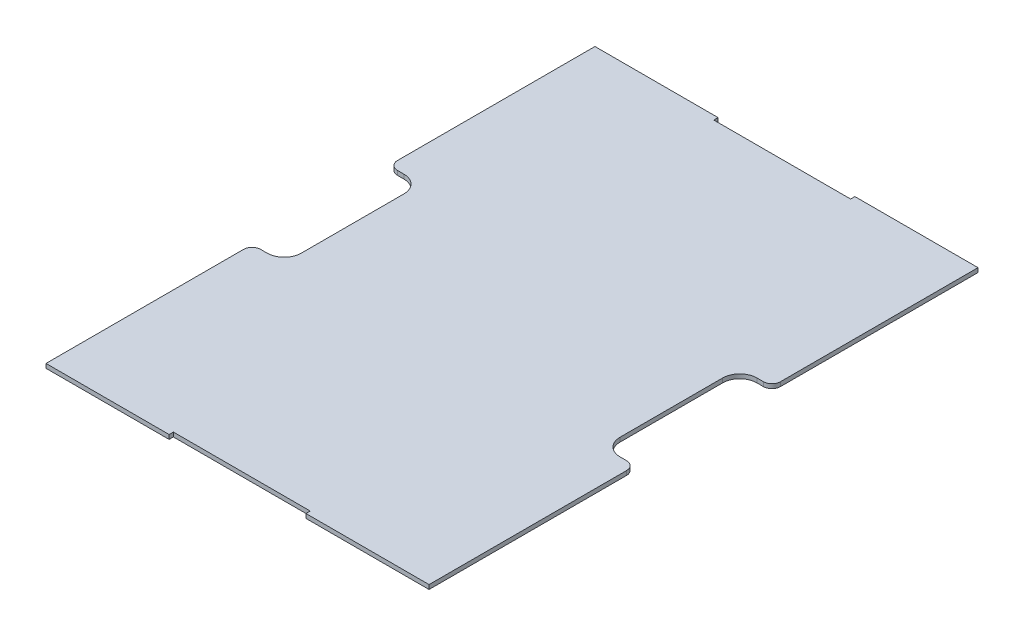
ISO-10303-21;
HEADER;
FILE_DESCRIPTION(('STEP AP214'),'2;1');
FILE_NAME('part.step','',(''),(''),'','','');
FILE_SCHEMA(('AUTOMOTIVE_DESIGN { 1 0 10303 214 1 1 1 1 }'));
ENDSEC;
DATA;
#1=APPLICATION_CONTEXT('core data for automotive mechanical design processes');
#2=APPLICATION_PROTOCOL_DEFINITION('international standard','automotive_design',2000,#1);
#3=PRODUCT_CONTEXT('',#1,'mechanical');
#4=PRODUCT('Part','Part','',(#3));
#5=PRODUCT_RELATED_PRODUCT_CATEGORY('part','',(#4));
#6=PRODUCT_DEFINITION_FORMATION('','',#4);
#7=PRODUCT_DEFINITION_CONTEXT('part definition',#1,'design');
#8=PRODUCT_DEFINITION('design','',#6,#7);
#9=PRODUCT_DEFINITION_SHAPE('','',#8);
#10=(LENGTH_UNIT() NAMED_UNIT(*) SI_UNIT(.MILLI.,.METRE.));
#11=(NAMED_UNIT(*) PLANE_ANGLE_UNIT() SI_UNIT($,.RADIAN.));
#12=(NAMED_UNIT(*) SI_UNIT($,.STERADIAN.) SOLID_ANGLE_UNIT());
#13=UNCERTAINTY_MEASURE_WITH_UNIT(LENGTH_MEASURE(1.E-05),#10,'distance_accuracy_value','');
#14=(GEOMETRIC_REPRESENTATION_CONTEXT(3) GLOBAL_UNCERTAINTY_ASSIGNED_CONTEXT((#13)) GLOBAL_UNIT_ASSIGNED_CONTEXT((#10,
#11,#12)) REPRESENTATION_CONTEXT('',''));
#15=CARTESIAN_POINT('',(0.,0.,0.));
#16=DIRECTION('',(0.,0.,1.));
#17=DIRECTION('',(1.,0.,0.));
#18=AXIS2_PLACEMENT_3D('',#15,#16,#17);
#19=CARTESIAN_POINT('',(-71.12,0.79375,-101.9175));
#20=DIRECTION('',(1.,0.,0.));
#21=DIRECTION('',(0.,0.,-1.));
#22=AXIS2_PLACEMENT_3D('',#19,#20,#21);
#23=PLANE('',#22);
#24=DIRECTION('',(0.,0.,1.));
#25=VECTOR('',#24,1.);
#26=CARTESIAN_POINT('',(-71.12,-0.79375,-101.9175));
#27=LINE('',#26,#25);
#28=CARTESIAN_POINT('',(-71.12,-0.79375,-101.9175));
#29=VERTEX_POINT('',#28);
#30=CARTESIAN_POINT('',(-71.12,-0.79375,-28.575));
#31=VERTEX_POINT('',#30);
#32=EDGE_CURVE('E279',#29,#31,#27,.T.);
#33=ORIENTED_EDGE('',*,*,#32,.T.);
#34=DIRECTION('',(0.,-1.,0.));
#35=VECTOR('',#34,1.);
#36=CARTESIAN_POINT('',(-71.12,0.79375,-28.575));
#37=LINE('',#36,#35);
#38=CARTESIAN_POINT('',(-71.12,0.79375,-28.575));
#39=VERTEX_POINT('',#38);
#40=EDGE_CURVE('E11',#31,#39,#37,.F.);
#41=ORIENTED_EDGE('',*,*,#40,.T.);
#42=DIRECTION('',(0.,0.,1.));
#43=VECTOR('',#42,1.);
#44=CARTESIAN_POINT('',(-71.12,0.79375,-101.9175));
#45=LINE('',#44,#43);
#46=CARTESIAN_POINT('',(-71.12,0.79375,-101.9175));
#47=VERTEX_POINT('',#46);
#48=EDGE_CURVE('E323',#47,#39,#45,.T.);
#49=ORIENTED_EDGE('',*,*,#48,.F.);
#50=DIRECTION('',(0.,-1.,0.));
#51=VECTOR('',#50,1.);
#52=CARTESIAN_POINT('',(-71.12,0.79375,-101.9175));
#53=LINE('',#52,#51);
#54=EDGE_CURVE('E278',#47,#29,#53,.T.);
#55=ORIENTED_EDGE('',*,*,#54,.T.);
#56=EDGE_LOOP('',(#33,#41,#49,#55));
#57=FACE_BOUND('',#56,.T.);
#58=ADVANCED_FACE('F34',(#57),#23,.F.);
#59=CARTESIAN_POINT('',(-71.12,0.79375,-25.4));
#60=DIRECTION('',(0.,0.,-1.));
#61=DIRECTION('',(-1.,0.,0.));
#62=AXIS2_PLACEMENT_3D('',#59,#60,#61);
#63=PLANE('',#62);
#64=DIRECTION('',(1.,0.,0.));
#65=VECTOR('',#64,1.);
#66=CARTESIAN_POINT('',(-71.12,0.79375,-25.4));
#67=LINE('',#66,#65);
#68=CARTESIAN_POINT('',(-67.945,0.79375,-25.4));
#69=VERTEX_POINT('',#68);
#70=CARTESIAN_POINT('',(-65.5320000000001,0.79375,-25.4));
#71=VERTEX_POINT('',#70);
#72=EDGE_CURVE('E425',#69,#71,#67,.T.);
#73=ORIENTED_EDGE('',*,*,#72,.F.);
#74=DIRECTION('',(0.,-1.,0.));
#75=VECTOR('',#74,1.);
#76=CARTESIAN_POINT('',(-67.945,0.79375,-25.4));
#77=LINE('',#76,#75);
#78=CARTESIAN_POINT('',(-67.945,-0.79375,-25.4));
#79=VERTEX_POINT('',#78);
#80=EDGE_CURVE('E42',#69,#79,#77,.T.);
#81=ORIENTED_EDGE('',*,*,#80,.T.);
#82=DIRECTION('',(1.,0.,0.));
#83=VECTOR('',#82,1.);
#84=CARTESIAN_POINT('',(-71.12,-0.79375,-25.4));
#85=LINE('',#84,#83);
#86=CARTESIAN_POINT('',(-65.5320000000001,-0.79375,-25.4));
#87=VERTEX_POINT('',#86);
#88=EDGE_CURVE('E282',#79,#87,#85,.T.);
#89=ORIENTED_EDGE('',*,*,#88,.T.);
#90=DIRECTION('',(0.,-1.,0.));
#91=VECTOR('',#90,1.);
#92=CARTESIAN_POINT('',(-65.5320000000001,0.79375,-25.4));
#93=LINE('',#92,#91);
#94=EDGE_CURVE('E372',#87,#71,#93,.F.);
#95=ORIENTED_EDGE('',*,*,#94,.T.);
#96=EDGE_LOOP('',(#73,#81,#89,#95));
#97=FACE_BOUND('',#96,.T.);
#98=ADVANCED_FACE('F424',(#97),#63,.F.);
#99=CARTESIAN_POINT('',(-59.182,0.79375,25.4));
#100=DIRECTION('',(1.,0.,0.));
#101=DIRECTION('',(0.,0.,-1.));
#102=AXIS2_PLACEMENT_3D('',#99,#100,#101);
#103=PLANE('',#102);
#104=DIRECTION('',(0.,0.,1.));
#105=VECTOR('',#104,1.);
#106=CARTESIAN_POINT('',(-59.182,-0.79375,25.4));
#107=LINE('',#106,#105);
#108=CARTESIAN_POINT('',(-59.182,-0.79375,-19.05));
#109=VERTEX_POINT('',#108);
#110=CARTESIAN_POINT('',(-59.182,-0.79375,19.05));
#111=VERTEX_POINT('',#110);
#112=EDGE_CURVE('E284',#109,#111,#107,.T.);
#113=ORIENTED_EDGE('',*,*,#112,.T.);
#114=DIRECTION('',(0.,-1.,0.));
#115=VECTOR('',#114,1.);
#116=CARTESIAN_POINT('',(-59.182,0.79375,19.05));
#117=LINE('',#116,#115);
#118=CARTESIAN_POINT('',(-59.182,0.79375,19.05));
#119=VERTEX_POINT('',#118);
#120=EDGE_CURVE('E370',#111,#119,#117,.F.);
#121=ORIENTED_EDGE('',*,*,#120,.T.);
#122=DIRECTION('',(0.,0.,1.));
#123=VECTOR('',#122,1.);
#124=CARTESIAN_POINT('',(-59.182,0.79375,25.4));
#125=LINE('',#124,#123);
#126=CARTESIAN_POINT('',(-59.182,0.79375,-19.05));
#127=VERTEX_POINT('',#126);
#128=EDGE_CURVE('E440',#127,#119,#125,.T.);
#129=ORIENTED_EDGE('',*,*,#128,.F.);
#130=DIRECTION('',(0.,-1.,0.));
#131=VECTOR('',#130,1.);
#132=CARTESIAN_POINT('',(-59.182,-0.79375,-19.05));
#133=LINE('',#132,#131);
#134=EDGE_CURVE('E367',#127,#109,#133,.T.);
#135=ORIENTED_EDGE('',*,*,#134,.T.);
#136=EDGE_LOOP('',(#113,#121,#129,#135));
#137=FACE_BOUND('',#136,.T.);
#138=ADVANCED_FACE('F443',(#137),#103,.F.);
#139=CARTESIAN_POINT('',(-71.12,0.79375,25.4));
#140=DIRECTION('',(0.,0.,1.));
#141=DIRECTION('',(1.,0.,0.));
#142=AXIS2_PLACEMENT_3D('',#139,#140,#141);
#143=PLANE('',#142);
#144=DIRECTION('',(-1.,0.,0.));
#145=VECTOR('',#144,1.);
#146=CARTESIAN_POINT('',(-71.12,-0.79375,25.4));
#147=LINE('',#146,#145);
#148=CARTESIAN_POINT('',(-65.532,-0.79375,25.4));
#149=VERTEX_POINT('',#148);
#150=CARTESIAN_POINT('',(-67.945,-0.79375,25.4));
#151=VERTEX_POINT('',#150);
#152=EDGE_CURVE('E287',#149,#151,#147,.T.);
#153=ORIENTED_EDGE('',*,*,#152,.T.);
#154=DIRECTION('',(0.,-1.,0.));
#155=VECTOR('',#154,1.);
#156=CARTESIAN_POINT('',(-67.945,0.79375,25.4));
#157=LINE('',#156,#155);
#158=CARTESIAN_POINT('',(-67.945,0.79375,25.4));
#159=VERTEX_POINT('',#158);
#160=EDGE_CURVE('E418',#151,#159,#157,.F.);
#161=ORIENTED_EDGE('',*,*,#160,.T.);
#162=DIRECTION('',(-1.,0.,0.));
#163=VECTOR('',#162,1.);
#164=CARTESIAN_POINT('',(-71.12,0.79375,25.4));
#165=LINE('',#164,#163);
#166=CARTESIAN_POINT('',(-65.532,0.79375,25.4));
#167=VERTEX_POINT('',#166);
#168=EDGE_CURVE('E231',#167,#159,#165,.T.);
#169=ORIENTED_EDGE('',*,*,#168,.F.);
#170=DIRECTION('',(0.,-1.,0.));
#171=VECTOR('',#170,1.);
#172=CARTESIAN_POINT('',(-65.532,-0.79375,25.4));
#173=LINE('',#172,#171);
#174=EDGE_CURVE('E364',#167,#149,#173,.T.);
#175=ORIENTED_EDGE('',*,*,#174,.T.);
#176=EDGE_LOOP('',(#153,#161,#169,#175));
#177=FACE_BOUND('',#176,.T.);
#178=ADVANCED_FACE('F616',(#177),#143,.F.);
#179=CARTESIAN_POINT('',(-71.12,0.79375,25.4));
#180=DIRECTION('',(1.,0.,0.));
#181=DIRECTION('',(0.,0.,-1.));
#182=AXIS2_PLACEMENT_3D('',#179,#180,#181);
#183=PLANE('',#182);
#184=DIRECTION('',(0.,0.,1.));
#185=VECTOR('',#184,1.);
#186=CARTESIAN_POINT('',(-71.12,0.79375,25.4));
#187=LINE('',#186,#185);
#188=CARTESIAN_POINT('',(-71.12,0.79375,28.575));
#189=VERTEX_POINT('',#188);
#190=CARTESIAN_POINT('',(-71.12,0.79375,101.9175));
#191=VERTEX_POINT('',#190);
#192=EDGE_CURVE('E218',#189,#191,#187,.T.);
#193=ORIENTED_EDGE('',*,*,#192,.F.);
#194=DIRECTION('',(0.,-1.,0.));
#195=VECTOR('',#194,1.);
#196=CARTESIAN_POINT('',(-71.12,0.79375,28.575));
#197=LINE('',#196,#195);
#198=CARTESIAN_POINT('',(-71.12,-0.79375,28.575));
#199=VERTEX_POINT('',#198);
#200=EDGE_CURVE('E416',#189,#199,#197,.T.);
#201=ORIENTED_EDGE('',*,*,#200,.T.);
#202=DIRECTION('',(0.,0.,1.));
#203=VECTOR('',#202,1.);
#204=CARTESIAN_POINT('',(-71.12,-0.79375,25.4));
#205=LINE('',#204,#203);
#206=CARTESIAN_POINT('',(-71.12,-0.79375,101.9175));
#207=VERTEX_POINT('',#206);
#208=EDGE_CURVE('E237',#199,#207,#205,.T.);
#209=ORIENTED_EDGE('',*,*,#208,.T.);
#210=DIRECTION('',(0.,-1.,0.));
#211=VECTOR('',#210,1.);
#212=CARTESIAN_POINT('',(-71.12,0.79375,101.9175));
#213=LINE('',#212,#211);
#214=EDGE_CURVE('E234',#191,#207,#213,.T.);
#215=ORIENTED_EDGE('',*,*,#214,.F.);
#216=EDGE_LOOP('',(#193,#201,#209,#215));
#217=FACE_BOUND('',#216,.T.);
#218=ADVANCED_FACE('F235',(#217),#183,.F.);
#219=CARTESIAN_POINT('',(-71.12,0.79375,101.9175));
#220=DIRECTION('',(0.,0.,-1.));
#221=DIRECTION('',(-1.,0.,0.));
#222=AXIS2_PLACEMENT_3D('',#219,#220,#221);
#223=PLANE('',#222);
#224=DIRECTION('',(1.,0.,0.));
#225=VECTOR('',#224,1.);
#226=CARTESIAN_POINT('',(-71.12,-0.79375,101.9175));
#227=LINE('',#226,#225);
#228=CARTESIAN_POINT('',(-25.4,-0.79375,101.9175));
#229=VERTEX_POINT('',#228);
#230=EDGE_CURVE('E291',#207,#229,#227,.T.);
#231=ORIENTED_EDGE('',*,*,#230,.T.);
#232=DIRECTION('',(0.,-1.,0.));
#233=VECTOR('',#232,1.);
#234=CARTESIAN_POINT('',(-25.4,0.79375,101.9175));
#235=LINE('',#234,#233);
#236=CARTESIAN_POINT('',(-25.4,0.79375,101.9175));
#237=VERTEX_POINT('',#236);
#238=EDGE_CURVE('E241',#237,#229,#235,.T.);
#239=ORIENTED_EDGE('',*,*,#238,.F.);
#240=DIRECTION('',(1.,0.,0.));
#241=VECTOR('',#240,1.);
#242=CARTESIAN_POINT('',(-71.12,0.79375,101.9175));
#243=LINE('',#242,#241);
#244=EDGE_CURVE('E223',#191,#237,#243,.T.);
#245=ORIENTED_EDGE('',*,*,#244,.F.);
#246=ORIENTED_EDGE('',*,*,#214,.T.);
#247=EDGE_LOOP('',(#231,#239,#245,#246));
#248=FACE_BOUND('',#247,.T.);
#249=ADVANCED_FACE('F243',(#248),#223,.F.);
#250=CARTESIAN_POINT('',(-25.4,0.79375,101.9175));
#251=DIRECTION('',(-1.,0.,0.));
#252=DIRECTION('',(0.,0.,1.));
#253=AXIS2_PLACEMENT_3D('',#250,#251,#252);
#254=PLANE('',#253);
#255=DIRECTION('',(0.,0.,-1.));
#256=VECTOR('',#255,1.);
#257=CARTESIAN_POINT('',(-25.4,-0.79375,101.9175));
#258=LINE('',#257,#256);
#259=CARTESIAN_POINT('',(-25.4,-0.79375,100.33));
#260=VERTEX_POINT('',#259);
#261=EDGE_CURVE('E293',#229,#260,#258,.T.);
#262=ORIENTED_EDGE('',*,*,#261,.T.);
#263=DIRECTION('',(0.,-1.,0.));
#264=VECTOR('',#263,1.);
#265=CARTESIAN_POINT('',(-25.4,0.79375,100.33));
#266=LINE('',#265,#264);
#267=CARTESIAN_POINT('',(-25.4,0.79375,100.33));
#268=VERTEX_POINT('',#267);
#269=EDGE_CURVE('E350',#268,#260,#266,.T.);
#270=ORIENTED_EDGE('',*,*,#269,.F.);
#271=DIRECTION('',(0.,0.,-1.));
#272=VECTOR('',#271,1.);
#273=CARTESIAN_POINT('',(-25.4,0.79375,101.9175));
#274=LINE('',#273,#272);
#275=EDGE_CURVE('E246',#237,#268,#274,.T.);
#276=ORIENTED_EDGE('',*,*,#275,.F.);
#277=ORIENTED_EDGE('',*,*,#238,.T.);
#278=EDGE_LOOP('',(#262,#270,#276,#277));
#279=FACE_BOUND('',#278,.T.);
#280=ADVANCED_FACE('F686',(#279),#254,.F.);
#281=CARTESIAN_POINT('',(-25.4,0.79375,100.33));
#282=DIRECTION('',(0.,0.,-1.));
#283=DIRECTION('',(-1.,0.,0.));
#284=AXIS2_PLACEMENT_3D('',#281,#282,#283);
#285=PLANE('',#284);
#286=DIRECTION('',(1.,0.,0.));
#287=VECTOR('',#286,1.);
#288=CARTESIAN_POINT('',(-25.4,-0.79375,100.33));
#289=LINE('',#288,#287);
#290=CARTESIAN_POINT('',(25.4,-0.79375,100.33));
#291=VERTEX_POINT('',#290);
#292=EDGE_CURVE('E295',#260,#291,#289,.T.);
#293=ORIENTED_EDGE('',*,*,#292,.T.);
#294=DIRECTION('',(0.,-1.,0.));
#295=VECTOR('',#294,1.);
#296=CARTESIAN_POINT('',(25.4,0.79375,100.33));
#297=LINE('',#296,#295);
#298=CARTESIAN_POINT('',(25.4,0.79375,100.33));
#299=VERTEX_POINT('',#298);
#300=EDGE_CURVE('E347',#299,#291,#297,.T.);
#301=ORIENTED_EDGE('',*,*,#300,.F.);
#302=DIRECTION('',(1.,0.,0.));
#303=VECTOR('',#302,1.);
#304=CARTESIAN_POINT('',(-25.4,0.79375,100.33));
#305=LINE('',#304,#303);
#306=EDGE_CURVE('E248',#268,#299,#305,.T.);
#307=ORIENTED_EDGE('',*,*,#306,.F.);
#308=ORIENTED_EDGE('',*,*,#269,.T.);
#309=EDGE_LOOP('',(#293,#301,#307,#308));
#310=FACE_BOUND('',#309,.T.);
#311=ADVANCED_FACE('F682',(#310),#285,.F.);
#312=CARTESIAN_POINT('',(25.4,0.79375,101.9175));
#313=DIRECTION('',(1.,0.,0.));
#314=DIRECTION('',(0.,0.,-1.));
#315=AXIS2_PLACEMENT_3D('',#312,#313,#314);
#316=PLANE('',#315);
#317=DIRECTION('',(0.,0.,1.));
#318=VECTOR('',#317,1.);
#319=CARTESIAN_POINT('',(25.4,-0.79375,101.9175));
#320=LINE('',#319,#318);
#321=CARTESIAN_POINT('',(25.4,-0.79375,101.9175));
#322=VERTEX_POINT('',#321);
#323=EDGE_CURVE('E297',#291,#322,#320,.T.);
#324=ORIENTED_EDGE('',*,*,#323,.T.);
#325=DIRECTION('',(0.,-1.,0.));
#326=VECTOR('',#325,1.);
#327=CARTESIAN_POINT('',(25.4,0.79375,101.9175));
#328=LINE('',#327,#326);
#329=CARTESIAN_POINT('',(25.4,0.79375,101.9175));
#330=VERTEX_POINT('',#329);
#331=EDGE_CURVE('E344',#330,#322,#328,.T.);
#332=ORIENTED_EDGE('',*,*,#331,.F.);
#333=DIRECTION('',(0.,0.,1.));
#334=VECTOR('',#333,1.);
#335=CARTESIAN_POINT('',(25.4,0.79375,101.9175));
#336=LINE('',#335,#334);
#337=EDGE_CURVE('E253',#299,#330,#336,.T.);
#338=ORIENTED_EDGE('',*,*,#337,.F.);
#339=ORIENTED_EDGE('',*,*,#300,.T.);
#340=EDGE_LOOP('',(#324,#332,#338,#339));
#341=FACE_BOUND('',#340,.T.);
#342=ADVANCED_FACE('F678',(#341),#316,.F.);
#343=CARTESIAN_POINT('',(25.4,0.79375,101.9175));
#344=DIRECTION('',(0.,0.,-1.));
#345=DIRECTION('',(-1.,0.,0.));
#346=AXIS2_PLACEMENT_3D('',#343,#344,#345);
#347=PLANE('',#346);
#348=DIRECTION('',(1.,0.,0.));
#349=VECTOR('',#348,1.);
#350=CARTESIAN_POINT('',(25.4,-0.79375,101.9175));
#351=LINE('',#350,#349);
#352=CARTESIAN_POINT('',(71.12,-0.79375,101.9175));
#353=VERTEX_POINT('',#352);
#354=EDGE_CURVE('E299',#322,#353,#351,.T.);
#355=ORIENTED_EDGE('',*,*,#354,.T.);
#356=DIRECTION('',(0.,-1.,0.));
#357=VECTOR('',#356,1.);
#358=CARTESIAN_POINT('',(71.12,0.79375,101.9175));
#359=LINE('',#358,#357);
#360=CARTESIAN_POINT('',(71.12,0.79375,101.9175));
#361=VERTEX_POINT('',#360);
#362=EDGE_CURVE('E341',#361,#353,#359,.T.);
#363=ORIENTED_EDGE('',*,*,#362,.F.);
#364=DIRECTION('',(1.,0.,0.));
#365=VECTOR('',#364,1.);
#366=CARTESIAN_POINT('',(25.4,0.79375,101.9175));
#367=LINE('',#366,#365);
#368=EDGE_CURVE('E255',#330,#361,#367,.T.);
#369=ORIENTED_EDGE('',*,*,#368,.F.);
#370=ORIENTED_EDGE('',*,*,#331,.T.);
#371=EDGE_LOOP('',(#355,#363,#369,#370));
#372=FACE_BOUND('',#371,.T.);
#373=ADVANCED_FACE('F604',(#372),#347,.F.);
#374=CARTESIAN_POINT('',(71.12,0.79375,25.4));
#375=DIRECTION('',(-1.,0.,0.));
#376=DIRECTION('',(0.,0.,1.));
#377=AXIS2_PLACEMENT_3D('',#374,#375,#376);
#378=PLANE('',#377);
#379=DIRECTION('',(0.,0.,-1.));
#380=VECTOR('',#379,1.);
#381=CARTESIAN_POINT('',(71.12,-0.79375,25.4));
#382=LINE('',#381,#380);
#383=CARTESIAN_POINT('',(71.12,-0.79375,28.575));
#384=VERTEX_POINT('',#383);
#385=EDGE_CURVE('E301',#353,#384,#382,.T.);
#386=ORIENTED_EDGE('',*,*,#385,.T.);
#387=DIRECTION('',(0.,-1.,0.));
#388=VECTOR('',#387,1.);
#389=CARTESIAN_POINT('',(71.12,0.79375,28.575));
#390=LINE('',#389,#388);
#391=CARTESIAN_POINT('',(71.12,0.79375,28.575));
#392=VERTEX_POINT('',#391);
#393=EDGE_CURVE('E404',#384,#392,#390,.F.);
#394=ORIENTED_EDGE('',*,*,#393,.T.);
#395=DIRECTION('',(0.,0.,-1.));
#396=VECTOR('',#395,1.);
#397=CARTESIAN_POINT('',(71.12,0.79375,25.4));
#398=LINE('',#397,#396);
#399=EDGE_CURVE('E257',#361,#392,#398,.T.);
#400=ORIENTED_EDGE('',*,*,#399,.F.);
#401=ORIENTED_EDGE('',*,*,#362,.T.);
#402=EDGE_LOOP('',(#386,#394,#400,#401));
#403=FACE_BOUND('',#402,.T.);
#404=ADVANCED_FACE('F594',(#403),#378,.F.);
#405=CARTESIAN_POINT('',(71.12,0.79375,25.4));
#406=DIRECTION('',(0.,0.,1.));
#407=DIRECTION('',(1.,0.,0.));
#408=AXIS2_PLACEMENT_3D('',#405,#406,#407);
#409=PLANE('',#408);
#410=DIRECTION('',(-1.,0.,0.));
#411=VECTOR('',#410,1.);
#412=CARTESIAN_POINT('',(71.12,0.79375,25.4));
#413=LINE('',#412,#411);
#414=CARTESIAN_POINT('',(67.945,0.79375,25.4));
#415=VERTEX_POINT('',#414);
#416=CARTESIAN_POINT('',(65.532,0.79375,25.4));
#417=VERTEX_POINT('',#416);
#418=EDGE_CURVE('E259',#415,#417,#413,.T.);
#419=ORIENTED_EDGE('',*,*,#418,.F.);
#420=DIRECTION('',(0.,-1.,0.));
#421=VECTOR('',#420,1.);
#422=CARTESIAN_POINT('',(67.945,0.79375,25.4));
#423=LINE('',#422,#421);
#424=CARTESIAN_POINT('',(67.945,-0.79375,25.4));
#425=VERTEX_POINT('',#424);
#426=EDGE_CURVE('E393',#415,#425,#423,.T.);
#427=ORIENTED_EDGE('',*,*,#426,.T.);
#428=DIRECTION('',(-1.,0.,0.));
#429=VECTOR('',#428,1.);
#430=CARTESIAN_POINT('',(71.12,-0.79375,25.4));
#431=LINE('',#430,#429);
#432=CARTESIAN_POINT('',(65.532,-0.79375,25.4));
#433=VERTEX_POINT('',#432);
#434=EDGE_CURVE('E304',#425,#433,#431,.T.);
#435=ORIENTED_EDGE('',*,*,#434,.T.);
#436=DIRECTION('',(0.,-1.,0.));
#437=VECTOR('',#436,1.);
#438=CARTESIAN_POINT('',(65.532,0.79375,25.4));
#439=LINE('',#438,#437);
#440=EDGE_CURVE('E358',#433,#417,#439,.F.);
#441=ORIENTED_EDGE('',*,*,#440,.T.);
#442=EDGE_LOOP('',(#419,#427,#435,#441));
#443=FACE_BOUND('',#442,.T.);
#444=ADVANCED_FACE('F589',(#443),#409,.F.);
#445=CARTESIAN_POINT('',(59.182,0.79375,25.4));
#446=DIRECTION('',(-1.,0.,0.));
#447=DIRECTION('',(0.,0.,1.));
#448=AXIS2_PLACEMENT_3D('',#445,#446,#447);
#449=PLANE('',#448);
#450=DIRECTION('',(0.,0.,-1.));
#451=VECTOR('',#450,1.);
#452=CARTESIAN_POINT('',(59.182,0.79375,25.4));
#453=LINE('',#452,#451);
#454=CARTESIAN_POINT('',(59.182,0.79375,19.05));
#455=VERTEX_POINT('',#454);
#456=CARTESIAN_POINT('',(59.182,0.79375,-19.05));
#457=VERTEX_POINT('',#456);
#458=EDGE_CURVE('E261',#455,#457,#453,.T.);
#459=ORIENTED_EDGE('',*,*,#458,.F.);
#460=DIRECTION('',(0.,-1.,0.));
#461=VECTOR('',#460,1.);
#462=CARTESIAN_POINT('',(59.182,-0.79375,19.05));
#463=LINE('',#462,#461);
#464=CARTESIAN_POINT('',(59.182,-0.79375,19.05));
#465=VERTEX_POINT('',#464);
#466=EDGE_CURVE('E355',#455,#465,#463,.T.);
#467=ORIENTED_EDGE('',*,*,#466,.T.);
#468=DIRECTION('',(0.,0.,-1.));
#469=VECTOR('',#468,1.);
#470=CARTESIAN_POINT('',(59.182,-0.79375,25.4));
#471=LINE('',#470,#469);
#472=CARTESIAN_POINT('',(59.182,-0.79375,-19.05));
#473=VERTEX_POINT('',#472);
#474=EDGE_CURVE('E306',#465,#473,#471,.T.);
#475=ORIENTED_EDGE('',*,*,#474,.T.);
#476=DIRECTION('',(0.,-1.,0.));
#477=VECTOR('',#476,1.);
#478=CARTESIAN_POINT('',(59.182,0.79375,-19.05));
#479=LINE('',#478,#477);
#480=EDGE_CURVE('E240',#473,#457,#479,.F.);
#481=ORIENTED_EDGE('',*,*,#480,.T.);
#482=EDGE_LOOP('',(#459,#467,#475,#481));
#483=FACE_BOUND('',#482,.T.);
#484=ADVANCED_FACE('F582',(#483),#449,.F.);
#485=CARTESIAN_POINT('',(71.12,0.79375,-25.4));
#486=DIRECTION('',(0.,0.,-1.));
#487=DIRECTION('',(-1.,0.,0.));
#488=AXIS2_PLACEMENT_3D('',#485,#486,#487);
#489=PLANE('',#488);
#490=DIRECTION('',(1.,0.,0.));
#491=VECTOR('',#490,1.);
#492=CARTESIAN_POINT('',(71.12,-0.79375,-25.4));
#493=LINE('',#492,#491);
#494=CARTESIAN_POINT('',(65.532,-0.79375,-25.4));
#495=VERTEX_POINT('',#494);
#496=CARTESIAN_POINT('',(67.945,-0.79375,-25.4));
#497=VERTEX_POINT('',#496);
#498=EDGE_CURVE('E309',#495,#497,#493,.T.);
#499=ORIENTED_EDGE('',*,*,#498,.T.);
#500=DIRECTION('',(0.,-1.,0.));
#501=VECTOR('',#500,1.);
#502=CARTESIAN_POINT('',(67.945,0.79375,-25.4));
#503=LINE('',#502,#501);
#504=CARTESIAN_POINT('',(67.945,0.79375,-25.4));
#505=VERTEX_POINT('',#504);
#506=EDGE_CURVE('E57',#497,#505,#503,.F.);
#507=ORIENTED_EDGE('',*,*,#506,.T.);
#508=DIRECTION('',(1.,0.,0.));
#509=VECTOR('',#508,1.);
#510=CARTESIAN_POINT('',(71.12,0.79375,-25.4));
#511=LINE('',#510,#509);
#512=CARTESIAN_POINT('',(65.532,0.79375,-25.4));
#513=VERTEX_POINT('',#512);
#514=EDGE_CURVE('E264',#513,#505,#511,.T.);
#515=ORIENTED_EDGE('',*,*,#514,.F.);
#516=DIRECTION('',(0.,-1.,0.));
#517=VECTOR('',#516,1.);
#518=CARTESIAN_POINT('',(65.532,-0.79375,-25.4));
#519=LINE('',#518,#517);
#520=EDGE_CURVE('E361',#513,#495,#519,.T.);
#521=ORIENTED_EDGE('',*,*,#520,.T.);
#522=EDGE_LOOP('',(#499,#507,#515,#521));
#523=FACE_BOUND('',#522,.T.);
#524=ADVANCED_FACE('F484',(#523),#489,.F.);
#525=CARTESIAN_POINT('',(71.12,0.79375,-101.9175));
#526=DIRECTION('',(-1.,0.,0.));
#527=DIRECTION('',(0.,0.,1.));
#528=AXIS2_PLACEMENT_3D('',#525,#526,#527);
#529=PLANE('',#528);
#530=DIRECTION('',(0.,0.,-1.));
#531=VECTOR('',#530,1.);
#532=CARTESIAN_POINT('',(71.12,0.79375,-101.9175));
#533=LINE('',#532,#531);
#534=CARTESIAN_POINT('',(71.12,0.79375,-28.575));
#535=VERTEX_POINT('',#534);
#536=CARTESIAN_POINT('',(71.12,0.79375,-101.9175));
#537=VERTEX_POINT('',#536);
#538=EDGE_CURVE('E266',#535,#537,#533,.T.);
#539=ORIENTED_EDGE('',*,*,#538,.F.);
#540=DIRECTION('',(0.,-1.,0.));
#541=VECTOR('',#540,1.);
#542=CARTESIAN_POINT('',(71.12,0.79375,-28.575));
#543=LINE('',#542,#541);
#544=CARTESIAN_POINT('',(71.12,-0.79375,-28.575));
#545=VERTEX_POINT('',#544);
#546=EDGE_CURVE('E412',#535,#545,#543,.T.);
#547=ORIENTED_EDGE('',*,*,#546,.T.);
#548=DIRECTION('',(0.,0.,-1.));
#549=VECTOR('',#548,1.);
#550=CARTESIAN_POINT('',(71.12,-0.79375,-101.9175));
#551=LINE('',#550,#549);
#552=CARTESIAN_POINT('',(71.12,-0.79375,-101.9175));
#553=VERTEX_POINT('',#552);
#554=EDGE_CURVE('E311',#545,#553,#551,.T.);
#555=ORIENTED_EDGE('',*,*,#554,.T.);
#556=DIRECTION('',(0.,-1.,0.));
#557=VECTOR('',#556,1.);
#558=CARTESIAN_POINT('',(71.12,0.79375,-101.9175));
#559=LINE('',#558,#557);
#560=EDGE_CURVE('E338',#537,#553,#559,.T.);
#561=ORIENTED_EDGE('',*,*,#560,.F.);
#562=EDGE_LOOP('',(#539,#547,#555,#561));
#563=FACE_BOUND('',#562,.T.);
#564=ADVANCED_FACE('F480',(#563),#529,.F.);
#565=CARTESIAN_POINT('',(25.4,0.79375,-101.9175));
#566=DIRECTION('',(0.,0.,1.));
#567=DIRECTION('',(1.,0.,0.));
#568=AXIS2_PLACEMENT_3D('',#565,#566,#567);
#569=PLANE('',#568);
#570=DIRECTION('',(-1.,0.,0.));
#571=VECTOR('',#570,1.);
#572=CARTESIAN_POINT('',(25.4,-0.79375,-101.9175));
#573=LINE('',#572,#571);
#574=CARTESIAN_POINT('',(25.4,-0.79375,-101.9175));
#575=VERTEX_POINT('',#574);
#576=EDGE_CURVE('E313',#553,#575,#573,.T.);
#577=ORIENTED_EDGE('',*,*,#576,.T.);
#578=DIRECTION('',(0.,-1.,0.));
#579=VECTOR('',#578,1.);
#580=CARTESIAN_POINT('',(25.4,0.79375,-101.9175));
#581=LINE('',#580,#579);
#582=CARTESIAN_POINT('',(25.4,0.79375,-101.9175));
#583=VERTEX_POINT('',#582);
#584=EDGE_CURVE('E335',#583,#575,#581,.T.);
#585=ORIENTED_EDGE('',*,*,#584,.F.);
#586=DIRECTION('',(-1.,0.,0.));
#587=VECTOR('',#586,1.);
#588=CARTESIAN_POINT('',(25.4,0.79375,-101.9175));
#589=LINE('',#588,#587);
#590=EDGE_CURVE('E268',#537,#583,#589,.T.);
#591=ORIENTED_EDGE('',*,*,#590,.F.);
#592=ORIENTED_EDGE('',*,*,#560,.T.);
#593=EDGE_LOOP('',(#577,#585,#591,#592));
#594=FACE_BOUND('',#593,.T.);
#595=ADVANCED_FACE('F477',(#594),#569,.F.);
#596=CARTESIAN_POINT('',(25.4,0.79375,-101.9175));
#597=DIRECTION('',(1.,0.,0.));
#598=DIRECTION('',(0.,0.,-1.));
#599=AXIS2_PLACEMENT_3D('',#596,#597,#598);
#600=PLANE('',#599);
#601=DIRECTION('',(0.,0.,1.));
#602=VECTOR('',#601,1.);
#603=CARTESIAN_POINT('',(25.4,-0.79375,-101.9175));
#604=LINE('',#603,#602);
#605=CARTESIAN_POINT('',(25.4,-0.79375,-100.33));
#606=VERTEX_POINT('',#605);
#607=EDGE_CURVE('E315',#575,#606,#604,.T.);
#608=ORIENTED_EDGE('',*,*,#607,.T.);
#609=DIRECTION('',(0.,-1.,0.));
#610=VECTOR('',#609,1.);
#611=CARTESIAN_POINT('',(25.4,0.79375,-100.33));
#612=LINE('',#611,#610);
#613=CARTESIAN_POINT('',(25.4,0.79375,-100.33));
#614=VERTEX_POINT('',#613);
#615=EDGE_CURVE('E332',#614,#606,#612,.T.);
#616=ORIENTED_EDGE('',*,*,#615,.F.);
#617=DIRECTION('',(0.,0.,1.));
#618=VECTOR('',#617,1.);
#619=CARTESIAN_POINT('',(25.4,0.79375,-101.9175));
#620=LINE('',#619,#618);
#621=EDGE_CURVE('E270',#583,#614,#620,.T.);
#622=ORIENTED_EDGE('',*,*,#621,.F.);
#623=ORIENTED_EDGE('',*,*,#584,.T.);
#624=EDGE_LOOP('',(#608,#616,#622,#623));
#625=FACE_BOUND('',#624,.T.);
#626=ADVANCED_FACE('F472',(#625),#600,.F.);
#627=CARTESIAN_POINT('',(-25.4,0.79375,-100.33));
#628=DIRECTION('',(0.,0.,1.));
#629=DIRECTION('',(1.,0.,0.));
#630=AXIS2_PLACEMENT_3D('',#627,#628,#629);
#631=PLANE('',#630);
#632=DIRECTION('',(-1.,0.,0.));
#633=VECTOR('',#632,1.);
#634=CARTESIAN_POINT('',(-25.4,-0.79375,-100.33));
#635=LINE('',#634,#633);
#636=CARTESIAN_POINT('',(-25.4,-0.79375,-100.33));
#637=VERTEX_POINT('',#636);
#638=EDGE_CURVE('E317',#606,#637,#635,.T.);
#639=ORIENTED_EDGE('',*,*,#638,.T.);
#640=DIRECTION('',(0.,-1.,0.));
#641=VECTOR('',#640,1.);
#642=CARTESIAN_POINT('',(-25.4,0.79375,-100.33));
#643=LINE('',#642,#641);
#644=CARTESIAN_POINT('',(-25.4,0.79375,-100.33));
#645=VERTEX_POINT('',#644);
#646=EDGE_CURVE('E329',#645,#637,#643,.T.);
#647=ORIENTED_EDGE('',*,*,#646,.F.);
#648=DIRECTION('',(-1.,0.,0.));
#649=VECTOR('',#648,1.);
#650=CARTESIAN_POINT('',(-25.4,0.79375,-100.33));
#651=LINE('',#650,#649);
#652=EDGE_CURVE('E272',#614,#645,#651,.T.);
#653=ORIENTED_EDGE('',*,*,#652,.F.);
#654=ORIENTED_EDGE('',*,*,#615,.T.);
#655=EDGE_LOOP('',(#639,#647,#653,#654));
#656=FACE_BOUND('',#655,.T.);
#657=ADVANCED_FACE('F466',(#656),#631,.F.);
#658=CARTESIAN_POINT('',(-25.4,0.79375,-101.9175));
#659=DIRECTION('',(-1.,0.,0.));
#660=DIRECTION('',(0.,0.,1.));
#661=AXIS2_PLACEMENT_3D('',#658,#659,#660);
#662=PLANE('',#661);
#663=DIRECTION('',(0.,0.,-1.));
#664=VECTOR('',#663,1.);
#665=CARTESIAN_POINT('',(-25.4,-0.79375,-101.9175));
#666=LINE('',#665,#664);
#667=CARTESIAN_POINT('',(-25.4,-0.79375,-101.9175));
#668=VERTEX_POINT('',#667);
#669=EDGE_CURVE('E319',#637,#668,#666,.T.);
#670=ORIENTED_EDGE('',*,*,#669,.T.);
#671=DIRECTION('',(0.,-1.,0.));
#672=VECTOR('',#671,1.);
#673=CARTESIAN_POINT('',(-25.4,0.79375,-101.9175));
#674=LINE('',#673,#672);
#675=CARTESIAN_POINT('',(-25.4,0.79375,-101.9175));
#676=VERTEX_POINT('',#675);
#677=EDGE_CURVE('E326',#676,#668,#674,.T.);
#678=ORIENTED_EDGE('',*,*,#677,.F.);
#679=DIRECTION('',(0.,0.,-1.));
#680=VECTOR('',#679,1.);
#681=CARTESIAN_POINT('',(-25.4,0.79375,-101.9175));
#682=LINE('',#681,#680);
#683=EDGE_CURVE('E274',#645,#676,#682,.T.);
#684=ORIENTED_EDGE('',*,*,#683,.F.);
#685=ORIENTED_EDGE('',*,*,#646,.T.);
#686=EDGE_LOOP('',(#670,#678,#684,#685));
#687=FACE_BOUND('',#686,.T.);
#688=ADVANCED_FACE('F462',(#687),#662,.F.);
#689=CARTESIAN_POINT('',(-71.12,0.79375,-101.9175));
#690=DIRECTION('',(0.,0.,1.));
#691=DIRECTION('',(1.,0.,0.));
#692=AXIS2_PLACEMENT_3D('',#689,#690,#691);
#693=PLANE('',#692);
#694=DIRECTION('',(-1.,0.,0.));
#695=VECTOR('',#694,1.);
#696=CARTESIAN_POINT('',(-71.12,-0.79375,-101.9175));
#697=LINE('',#696,#695);
#698=EDGE_CURVE('E321',#668,#29,#697,.T.);
#699=ORIENTED_EDGE('',*,*,#698,.T.);
#700=ORIENTED_EDGE('',*,*,#54,.F.);
#701=DIRECTION('',(-1.,0.,0.));
#702=VECTOR('',#701,1.);
#703=CARTESIAN_POINT('',(-71.12,0.79375,-101.9175));
#704=LINE('',#703,#702);
#705=EDGE_CURVE('E276',#676,#47,#704,.T.);
#706=ORIENTED_EDGE('',*,*,#705,.F.);
#707=ORIENTED_EDGE('',*,*,#677,.T.);
#708=EDGE_LOOP('',(#699,#700,#706,#707));
#709=FACE_BOUND('',#708,.T.);
#710=ADVANCED_FACE('F458',(#709),#693,.F.);
#711=CARTESIAN_POINT('',(0.,0.79375,0.));
#712=DIRECTION('',(0.,1.,0.));
#713=DIRECTION('',(0.,0.,1.));
#714=AXIS2_PLACEMENT_3D('',#711,#712,#713);
#715=PLANE('',#714);
#716=ORIENTED_EDGE('',*,*,#399,.T.);
#717=CARTESIAN_POINT('',(67.945,0.79375,28.575));
#718=DIRECTION('',(0.,1.,0.));
#719=DIRECTION('',(0.,0.,1.));
#720=AXIS2_PLACEMENT_3D('',#717,#718,#719);
#721=CIRCLE('',#720,3.175);
#722=EDGE_CURVE('E410',#392,#415,#721,.T.);
#723=ORIENTED_EDGE('',*,*,#722,.T.);
#724=ORIENTED_EDGE('',*,*,#418,.T.);
#725=CARTESIAN_POINT('',(65.532,0.79375,19.05));
#726=DIRECTION('',(0.,1.,0.));
#727=DIRECTION('',(0.,0.,1.));
#728=AXIS2_PLACEMENT_3D('',#725,#726,#727);
#729=CIRCLE('',#728,6.35);
#730=EDGE_CURVE('E378',#417,#455,#729,.F.);
#731=ORIENTED_EDGE('',*,*,#730,.T.);
#732=ORIENTED_EDGE('',*,*,#458,.T.);
#733=CARTESIAN_POINT('',(65.532,0.79375,-19.05));
#734=DIRECTION('',(0.,1.,0.));
#735=DIRECTION('',(0.,0.,1.));
#736=AXIS2_PLACEMENT_3D('',#733,#734,#735);
#737=CIRCLE('',#736,6.35);
#738=EDGE_CURVE('E382',#457,#513,#737,.F.);
#739=ORIENTED_EDGE('',*,*,#738,.T.);
#740=ORIENTED_EDGE('',*,*,#514,.T.);
#741=CARTESIAN_POINT('',(67.945,0.79375,-28.575));
#742=DIRECTION('',(0.,1.,0.));
#743=DIRECTION('',(0.,0.,1.));
#744=AXIS2_PLACEMENT_3D('',#741,#742,#743);
#745=CIRCLE('',#744,3.175);
#746=EDGE_CURVE('E49',#505,#535,#745,.T.);
#747=ORIENTED_EDGE('',*,*,#746,.T.);
#748=ORIENTED_EDGE('',*,*,#538,.T.);
#749=ORIENTED_EDGE('',*,*,#590,.T.);
#750=ORIENTED_EDGE('',*,*,#621,.T.);
#751=ORIENTED_EDGE('',*,*,#652,.T.);
#752=ORIENTED_EDGE('',*,*,#683,.T.);
#753=ORIENTED_EDGE('',*,*,#705,.T.);
#754=ORIENTED_EDGE('',*,*,#48,.T.);
#755=CARTESIAN_POINT('',(-67.945,0.79375,-28.575));
#756=DIRECTION('',(0.,1.,0.));
#757=DIRECTION('',(0.,0.,1.));
#758=AXIS2_PLACEMENT_3D('',#755,#756,#757);
#759=CIRCLE('',#758,3.175);
#760=EDGE_CURVE('E406',#39,#69,#759,.T.);
#761=ORIENTED_EDGE('',*,*,#760,.T.);
#762=ORIENTED_EDGE('',*,*,#72,.T.);
#763=CARTESIAN_POINT('',(-65.5320000000001,0.79375,-19.05));
#764=DIRECTION('',(0.,1.,0.));
#765=DIRECTION('',(0.,0.,1.));
#766=AXIS2_PLACEMENT_3D('',#763,#764,#765);
#767=CIRCLE('',#766,6.35);
#768=EDGE_CURVE('E391',#71,#127,#767,.F.);
#769=ORIENTED_EDGE('',*,*,#768,.T.);
#770=ORIENTED_EDGE('',*,*,#128,.T.);
#771=CARTESIAN_POINT('',(-65.532,0.79375,19.05));
#772=DIRECTION('',(0.,1.,0.));
#773=DIRECTION('',(0.,0.,1.));
#774=AXIS2_PLACEMENT_3D('',#771,#772,#773);
#775=CIRCLE('',#774,6.35);
#776=EDGE_CURVE('E386',#119,#167,#775,.F.);
#777=ORIENTED_EDGE('',*,*,#776,.T.);
#778=ORIENTED_EDGE('',*,*,#168,.T.);
#779=CARTESIAN_POINT('',(-67.945,0.79375,28.575));
#780=DIRECTION('',(0.,1.,0.));
#781=DIRECTION('',(0.,0.,1.));
#782=AXIS2_PLACEMENT_3D('',#779,#780,#781);
#783=CIRCLE('',#782,3.175);
#784=EDGE_CURVE('E227',#159,#189,#783,.T.);
#785=ORIENTED_EDGE('',*,*,#784,.T.);
#786=ORIENTED_EDGE('',*,*,#192,.T.);
#787=ORIENTED_EDGE('',*,*,#244,.T.);
#788=ORIENTED_EDGE('',*,*,#275,.T.);
#789=ORIENTED_EDGE('',*,*,#306,.T.);
#790=ORIENTED_EDGE('',*,*,#337,.T.);
#791=ORIENTED_EDGE('',*,*,#368,.T.);
#792=EDGE_LOOP('',(#716,#723,#724,#731,#732,#739,#740,#747,#748,#749,#750,#751,#752,#753,#754,
#761,#762,#769,#770,#777,#778,#785,#786,#787,#788,#789,#790,#791));
#793=FACE_BOUND('',#792,.T.);
#794=ADVANCED_FACE('F221',(#793),#715,.T.);
#795=CARTESIAN_POINT('',(0.,-0.79375,0.));
#796=DIRECTION('',(0.,1.,0.));
#797=DIRECTION('',(0.,0.,1.));
#798=AXIS2_PLACEMENT_3D('',#795,#796,#797);
#799=PLANE('',#798);
#800=ORIENTED_EDGE('',*,*,#434,.F.);
#801=CARTESIAN_POINT('',(67.945,-0.79375,28.575));
#802=DIRECTION('',(0.,1.,0.));
#803=DIRECTION('',(0.,0.,1.));
#804=AXIS2_PLACEMENT_3D('',#801,#802,#803);
#805=CIRCLE('',#804,3.175);
#806=EDGE_CURVE('E402',#425,#384,#805,.F.);
#807=ORIENTED_EDGE('',*,*,#806,.T.);
#808=ORIENTED_EDGE('',*,*,#385,.F.);
#809=ORIENTED_EDGE('',*,*,#354,.F.);
#810=ORIENTED_EDGE('',*,*,#323,.F.);
#811=ORIENTED_EDGE('',*,*,#292,.F.);
#812=ORIENTED_EDGE('',*,*,#261,.F.);
#813=ORIENTED_EDGE('',*,*,#230,.F.);
#814=ORIENTED_EDGE('',*,*,#208,.F.);
#815=CARTESIAN_POINT('',(-67.945,-0.79375,28.575));
#816=DIRECTION('',(0.,1.,0.));
#817=DIRECTION('',(0.,0.,1.));
#818=AXIS2_PLACEMENT_3D('',#815,#816,#817);
#819=CIRCLE('',#818,3.175);
#820=EDGE_CURVE('E398',#199,#151,#819,.F.);
#821=ORIENTED_EDGE('',*,*,#820,.T.);
#822=ORIENTED_EDGE('',*,*,#152,.F.);
#823=CARTESIAN_POINT('',(-65.532,-0.79375,19.05));
#824=DIRECTION('',(0.,1.,0.));
#825=DIRECTION('',(0.,0.,1.));
#826=AXIS2_PLACEMENT_3D('',#823,#824,#825);
#827=CIRCLE('',#826,6.35);
#828=EDGE_CURVE('E384',#149,#111,#827,.T.);
#829=ORIENTED_EDGE('',*,*,#828,.T.);
#830=ORIENTED_EDGE('',*,*,#112,.F.);
#831=CARTESIAN_POINT('',(-65.5320000000001,-0.79375,-19.05));
#832=DIRECTION('',(0.,1.,0.));
#833=DIRECTION('',(0.,0.,1.));
#834=AXIS2_PLACEMENT_3D('',#831,#832,#833);
#835=CIRCLE('',#834,6.35);
#836=EDGE_CURVE('E388',#109,#87,#835,.T.);
#837=ORIENTED_EDGE('',*,*,#836,.T.);
#838=ORIENTED_EDGE('',*,*,#88,.F.);
#839=CARTESIAN_POINT('',(-67.945,-0.79375,-28.575));
#840=DIRECTION('',(0.,1.,0.));
#841=DIRECTION('',(0.,0.,1.));
#842=AXIS2_PLACEMENT_3D('',#839,#840,#841);
#843=CIRCLE('',#842,3.175);
#844=EDGE_CURVE('E396',#79,#31,#843,.F.);
#845=ORIENTED_EDGE('',*,*,#844,.T.);
#846=ORIENTED_EDGE('',*,*,#32,.F.);
#847=ORIENTED_EDGE('',*,*,#698,.F.);
#848=ORIENTED_EDGE('',*,*,#669,.F.);
#849=ORIENTED_EDGE('',*,*,#638,.F.);
#850=ORIENTED_EDGE('',*,*,#607,.F.);
#851=ORIENTED_EDGE('',*,*,#576,.F.);
#852=ORIENTED_EDGE('',*,*,#554,.F.);
#853=CARTESIAN_POINT('',(67.945,-0.79375,-28.575));
#854=DIRECTION('',(0.,1.,0.));
#855=DIRECTION('',(0.,0.,1.));
#856=AXIS2_PLACEMENT_3D('',#853,#854,#855);
#857=CIRCLE('',#856,3.175);
#858=EDGE_CURVE('E400',#545,#497,#857,.F.);
#859=ORIENTED_EDGE('',*,*,#858,.T.);
#860=ORIENTED_EDGE('',*,*,#498,.F.);
#861=CARTESIAN_POINT('',(65.532,-0.79375,-19.05));
#862=DIRECTION('',(0.,1.,0.));
#863=DIRECTION('',(0.,0.,1.));
#864=AXIS2_PLACEMENT_3D('',#861,#862,#863);
#865=CIRCLE('',#864,6.35);
#866=EDGE_CURVE('E380',#495,#473,#865,.T.);
#867=ORIENTED_EDGE('',*,*,#866,.T.);
#868=ORIENTED_EDGE('',*,*,#474,.F.);
#869=CARTESIAN_POINT('',(65.532,-0.79375,19.05));
#870=DIRECTION('',(0.,1.,0.));
#871=DIRECTION('',(0.,0.,1.));
#872=AXIS2_PLACEMENT_3D('',#869,#870,#871);
#873=CIRCLE('',#872,6.35);
#874=EDGE_CURVE('E375',#465,#433,#873,.T.);
#875=ORIENTED_EDGE('',*,*,#874,.T.);
#876=EDGE_LOOP('',(#800,#807,#808,#809,#810,#811,#812,#813,#814,#821,#822,#829,#830,#837,#838,
#845,#846,#847,#848,#849,#850,#851,#852,#859,#860,#867,#868,#875));
#877=FACE_BOUND('',#876,.T.);
#878=ADVANCED_FACE('F430',(#877),#799,.F.);
#879=CARTESIAN_POINT('',(65.532,0.79375,19.05));
#880=DIRECTION('',(0.,1.,0.));
#881=DIRECTION('',(0.,0.,1.));
#882=AXIS2_PLACEMENT_3D('',#879,#880,#881);
#883=CYLINDRICAL_SURFACE('',#882,6.35);
#884=ORIENTED_EDGE('',*,*,#730,.F.);
#885=ORIENTED_EDGE('',*,*,#440,.F.);
#886=ORIENTED_EDGE('',*,*,#874,.F.);
#887=ORIENTED_EDGE('',*,*,#466,.F.);
#888=EDGE_LOOP('',(#884,#885,#886,#887));
#889=FACE_BOUND('',#888,.T.);
#890=ADVANCED_FACE('F506',(#889),#883,.F.);
#891=CARTESIAN_POINT('',(65.532,0.79375,-19.05));
#892=DIRECTION('',(0.,1.,0.));
#893=DIRECTION('',(0.,0.,1.));
#894=AXIS2_PLACEMENT_3D('',#891,#892,#893);
#895=CYLINDRICAL_SURFACE('',#894,6.35);
#896=ORIENTED_EDGE('',*,*,#738,.F.);
#897=ORIENTED_EDGE('',*,*,#480,.F.);
#898=ORIENTED_EDGE('',*,*,#866,.F.);
#899=ORIENTED_EDGE('',*,*,#520,.F.);
#900=EDGE_LOOP('',(#896,#897,#898,#899));
#901=FACE_BOUND('',#900,.T.);
#902=ADVANCED_FACE('F509',(#901),#895,.F.);
#903=CARTESIAN_POINT('',(-65.532,0.79375,19.05));
#904=DIRECTION('',(0.,1.,0.));
#905=DIRECTION('',(0.,0.,1.));
#906=AXIS2_PLACEMENT_3D('',#903,#904,#905);
#907=CYLINDRICAL_SURFACE('',#906,6.35);
#908=ORIENTED_EDGE('',*,*,#776,.F.);
#909=ORIENTED_EDGE('',*,*,#120,.F.);
#910=ORIENTED_EDGE('',*,*,#828,.F.);
#911=ORIENTED_EDGE('',*,*,#174,.F.);
#912=EDGE_LOOP('',(#908,#909,#910,#911));
#913=FACE_BOUND('',#912,.T.);
#914=ADVANCED_FACE('F513',(#913),#907,.F.);
#915=CARTESIAN_POINT('',(-65.5320000000001,0.79375,-19.05));
#916=DIRECTION('',(0.,1.,0.));
#917=DIRECTION('',(0.,0.,1.));
#918=AXIS2_PLACEMENT_3D('',#915,#916,#917);
#919=CYLINDRICAL_SURFACE('',#918,6.35);
#920=ORIENTED_EDGE('',*,*,#768,.F.);
#921=ORIENTED_EDGE('',*,*,#94,.F.);
#922=ORIENTED_EDGE('',*,*,#836,.F.);
#923=ORIENTED_EDGE('',*,*,#134,.F.);
#924=EDGE_LOOP('',(#920,#921,#922,#923));
#925=FACE_BOUND('',#924,.T.);
#926=ADVANCED_FACE('F437',(#925),#919,.F.);
#927=CARTESIAN_POINT('',(67.945,0.79375,28.575));
#928=DIRECTION('',(0.,-1.,0.));
#929=DIRECTION('',(0.,0.,-1.));
#930=AXIS2_PLACEMENT_3D('',#927,#928,#929);
#931=CYLINDRICAL_SURFACE('',#930,3.175);
#932=ORIENTED_EDGE('',*,*,#722,.F.);
#933=ORIENTED_EDGE('',*,*,#393,.F.);
#934=ORIENTED_EDGE('',*,*,#806,.F.);
#935=ORIENTED_EDGE('',*,*,#426,.F.);
#936=EDGE_LOOP('',(#932,#933,#934,#935));
#937=FACE_BOUND('',#936,.T.);
#938=ADVANCED_FACE('F489',(#937),#931,.T.);
#939=CARTESIAN_POINT('',(67.945,0.79375,-28.575));
#940=DIRECTION('',(0.,-1.,0.));
#941=DIRECTION('',(0.,0.,-1.));
#942=AXIS2_PLACEMENT_3D('',#939,#940,#941);
#943=CYLINDRICAL_SURFACE('',#942,3.175);
#944=ORIENTED_EDGE('',*,*,#746,.F.);
#945=ORIENTED_EDGE('',*,*,#506,.F.);
#946=ORIENTED_EDGE('',*,*,#858,.F.);
#947=ORIENTED_EDGE('',*,*,#546,.F.);
#948=EDGE_LOOP('',(#944,#945,#946,#947));
#949=FACE_BOUND('',#948,.T.);
#950=ADVANCED_FACE('F486',(#949),#943,.T.);
#951=CARTESIAN_POINT('',(-67.945,0.79375,28.575));
#952=DIRECTION('',(0.,-1.,0.));
#953=DIRECTION('',(0.,0.,-1.));
#954=AXIS2_PLACEMENT_3D('',#951,#952,#953);
#955=CYLINDRICAL_SURFACE('',#954,3.175);
#956=ORIENTED_EDGE('',*,*,#784,.F.);
#957=ORIENTED_EDGE('',*,*,#160,.F.);
#958=ORIENTED_EDGE('',*,*,#820,.F.);
#959=ORIENTED_EDGE('',*,*,#200,.F.);
#960=EDGE_LOOP('',(#956,#957,#958,#959));
#961=FACE_BOUND('',#960,.T.);
#962=ADVANCED_FACE('F488',(#961),#955,.T.);
#963=CARTESIAN_POINT('',(-67.945,0.79375,-28.575));
#964=DIRECTION('',(0.,-1.,0.));
#965=DIRECTION('',(0.,0.,-1.));
#966=AXIS2_PLACEMENT_3D('',#963,#964,#965);
#967=CYLINDRICAL_SURFACE('',#966,3.175);
#968=ORIENTED_EDGE('',*,*,#760,.F.);
#969=ORIENTED_EDGE('',*,*,#40,.F.);
#970=ORIENTED_EDGE('',*,*,#844,.F.);
#971=ORIENTED_EDGE('',*,*,#80,.F.);
#972=EDGE_LOOP('',(#968,#969,#970,#971));
#973=FACE_BOUND('',#972,.T.);
#974=ADVANCED_FACE('F36',(#973),#967,.T.);
#975=CLOSED_SHELL('',(#58,#98,#138,#178,#218,#249,#280,#311,#342,#373,#404,#444,#484,#524,#564,
#595,#626,#657,#688,#710,#794,#878,#890,#902,#914,#926,#938,#950,#962,#974));
#976=MANIFOLD_SOLID_BREP('B2',#975);
#977=ADVANCED_BREP_SHAPE_REPRESENTATION('',(#18,#976),#14);
#978=SHAPE_DEFINITION_REPRESENTATION(#9,#977);
ENDSEC;
END-ISO-10303-21;
